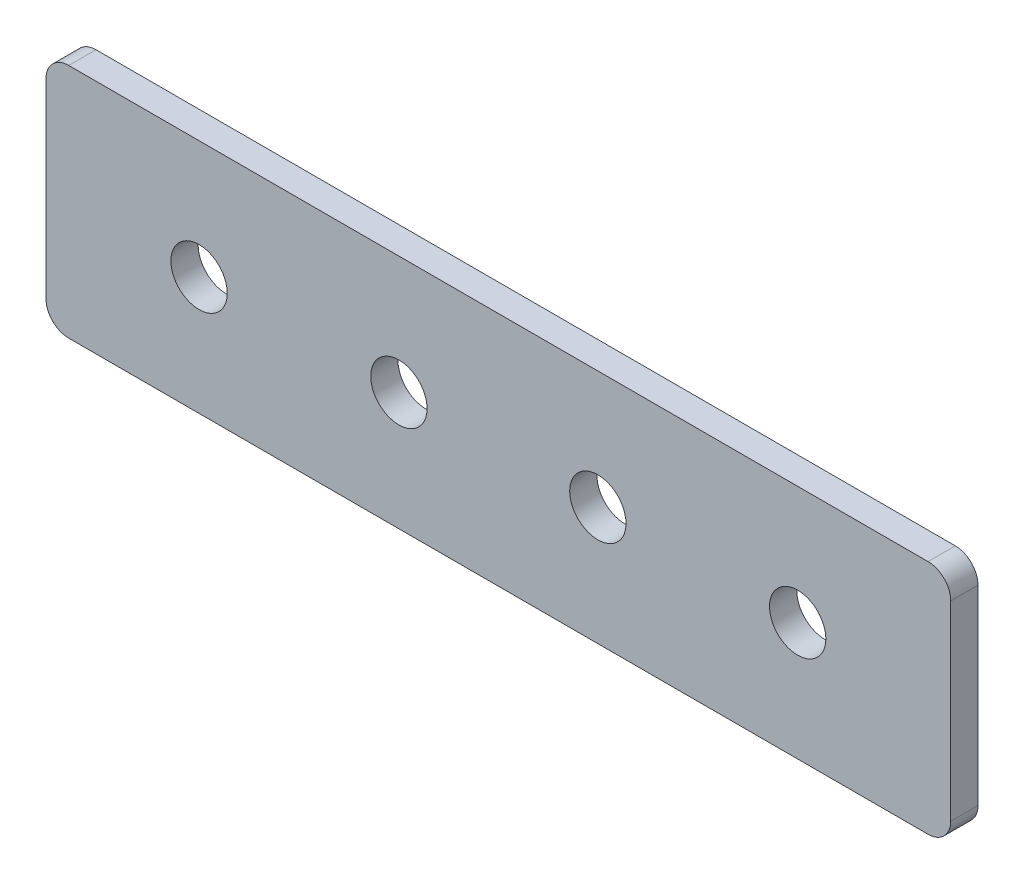
ISO-10303-21;
HEADER;
FILE_DESCRIPTION(('STEP AP214'),'2;1');
FILE_NAME('part.step','',(''),(''),'','','');
FILE_SCHEMA(('AUTOMOTIVE_DESIGN { 1 0 10303 214 1 1 1 1 }'));
ENDSEC;
DATA;
#1=APPLICATION_CONTEXT('core data for automotive mechanical design processes');
#2=APPLICATION_PROTOCOL_DEFINITION('international standard','automotive_design',2000,#1);
#3=PRODUCT_CONTEXT('',#1,'mechanical');
#4=PRODUCT('Part','Part','',(#3));
#5=PRODUCT_RELATED_PRODUCT_CATEGORY('part','',(#4));
#6=PRODUCT_DEFINITION_FORMATION('','',#4);
#7=PRODUCT_DEFINITION_CONTEXT('part definition',#1,'design');
#8=PRODUCT_DEFINITION('design','',#6,#7);
#9=PRODUCT_DEFINITION_SHAPE('','',#8);
#10=(LENGTH_UNIT() NAMED_UNIT(*) SI_UNIT(.MILLI.,.METRE.));
#11=(NAMED_UNIT(*) PLANE_ANGLE_UNIT() SI_UNIT($,.RADIAN.));
#12=(NAMED_UNIT(*) SI_UNIT($,.STERADIAN.) SOLID_ANGLE_UNIT());
#13=UNCERTAINTY_MEASURE_WITH_UNIT(LENGTH_MEASURE(1.E-05),#10,'distance_accuracy_value','');
#14=(GEOMETRIC_REPRESENTATION_CONTEXT(3) GLOBAL_UNCERTAINTY_ASSIGNED_CONTEXT((#13)) GLOBAL_UNIT_ASSIGNED_CONTEXT((#10,
#11,#12)) REPRESENTATION_CONTEXT('',''));
#15=CARTESIAN_POINT('',(0.,0.,0.));
#16=DIRECTION('',(0.,0.,1.));
#17=DIRECTION('',(1.,0.,0.));
#18=AXIS2_PLACEMENT_3D('',#15,#16,#17);
#19=CARTESIAN_POINT('',(49.8,-13.,2.5));
#20=DIRECTION('',(-1.,0.,0.));
#21=DIRECTION('',(0.,1.,0.));
#22=AXIS2_PLACEMENT_3D('',#19,#20,#21);
#23=PLANE('',#22);
#24=DIRECTION('',(0.,0.,1.));
#25=VECTOR('',#24,1.);
#26=CARTESIAN_POINT('',(49.8,-10.5,2.5));
#27=LINE('',#26,#25);
#28=CARTESIAN_POINT('',(49.8,-10.5,-0.5));
#29=VERTEX_POINT('',#28);
#30=CARTESIAN_POINT('',(49.8,-10.5,2.5));
#31=VERTEX_POINT('',#30);
#32=EDGE_CURVE('E11',#29,#31,#27,.T.);
#33=ORIENTED_EDGE('',*,*,#32,.F.);
#34=DIRECTION('',(0.,1.,0.));
#35=VECTOR('',#34,1.);
#36=CARTESIAN_POINT('',(49.8,0.,-0.5));
#37=LINE('',#36,#35);
#38=CARTESIAN_POINT('',(49.8,10.5,-0.5));
#39=VERTEX_POINT('',#38);
#40=EDGE_CURVE('E113',#29,#39,#37,.T.);
#41=ORIENTED_EDGE('',*,*,#40,.T.);
#42=DIRECTION('',(0.,0.,1.));
#43=VECTOR('',#42,1.);
#44=CARTESIAN_POINT('',(49.8,10.5,2.5));
#45=LINE('',#44,#43);
#46=CARTESIAN_POINT('',(49.8,10.5,2.5));
#47=VERTEX_POINT('',#46);
#48=EDGE_CURVE('E55',#39,#47,#45,.T.);
#49=ORIENTED_EDGE('',*,*,#48,.T.);
#50=DIRECTION('',(0.,1.,0.));
#51=VECTOR('',#50,1.);
#52=CARTESIAN_POINT('',(49.8,-13.,2.5));
#53=LINE('',#52,#51);
#54=EDGE_CURVE('E173',#31,#47,#53,.T.);
#55=ORIENTED_EDGE('',*,*,#54,.F.);
#56=EDGE_LOOP('',(#33,#41,#49,#55));
#57=FACE_BOUND('',#56,.T.);
#58=ADVANCED_FACE('F44',(#57),#23,.F.);
#59=CARTESIAN_POINT('',(47.3,10.5,2.5));
#60=DIRECTION('',(0.,0.,-1.));
#61=DIRECTION('',(-1.,0.,0.));
#62=AXIS2_PLACEMENT_3D('',#59,#60,#61);
#63=CYLINDRICAL_SURFACE('',#62,2.5);
#64=ORIENTED_EDGE('',*,*,#48,.F.);
#65=CARTESIAN_POINT('',(47.3,10.5,-0.5));
#66=DIRECTION('',(0.,0.,-1.));
#67=DIRECTION('',(-1.,0.,0.));
#68=AXIS2_PLACEMENT_3D('',#65,#66,#67);
#69=CIRCLE('',#68,2.5);
#70=CARTESIAN_POINT('',(47.3,13.,-0.5));
#71=VERTEX_POINT('',#70);
#72=EDGE_CURVE('E143',#39,#71,#69,.F.);
#73=ORIENTED_EDGE('',*,*,#72,.T.);
#74=DIRECTION('',(0.,0.,1.));
#75=VECTOR('',#74,1.);
#76=CARTESIAN_POINT('',(47.3,13.,2.5));
#77=LINE('',#76,#75);
#78=CARTESIAN_POINT('',(47.3,13.,2.5));
#79=VERTEX_POINT('',#78);
#80=EDGE_CURVE('E162',#71,#79,#77,.T.);
#81=ORIENTED_EDGE('',*,*,#80,.T.);
#82=CARTESIAN_POINT('',(47.3,10.5,2.5));
#83=DIRECTION('',(0.,0.,-1.));
#84=DIRECTION('',(-1.,0.,0.));
#85=AXIS2_PLACEMENT_3D('',#82,#83,#84);
#86=CIRCLE('',#85,2.5);
#87=EDGE_CURVE('E182',#47,#79,#86,.F.);
#88=ORIENTED_EDGE('',*,*,#87,.F.);
#89=EDGE_LOOP('',(#64,#73,#81,#88));
#90=FACE_BOUND('',#89,.T.);
#91=ADVANCED_FACE('F186',(#90),#63,.T.);
#92=CARTESIAN_POINT('',(-49.8,13.,2.5));
#93=DIRECTION('',(0.,-1.,0.));
#94=DIRECTION('',(-1.,0.,0.));
#95=AXIS2_PLACEMENT_3D('',#92,#93,#94);
#96=PLANE('',#95);
#97=ORIENTED_EDGE('',*,*,#80,.F.);
#98=DIRECTION('',(-1.,0.,0.));
#99=VECTOR('',#98,1.);
#100=CARTESIAN_POINT('',(0.,13.,-0.5));
#101=LINE('',#100,#99);
#102=CARTESIAN_POINT('',(-47.3,13.,-0.5));
#103=VERTEX_POINT('',#102);
#104=EDGE_CURVE('E139',#71,#103,#101,.T.);
#105=ORIENTED_EDGE('',*,*,#104,.T.);
#106=DIRECTION('',(0.,0.,1.));
#107=VECTOR('',#106,1.);
#108=CARTESIAN_POINT('',(-47.3,13.,2.5));
#109=LINE('',#108,#107);
#110=CARTESIAN_POINT('',(-47.3,13.,2.5));
#111=VERTEX_POINT('',#110);
#112=EDGE_CURVE('E158',#103,#111,#109,.T.);
#113=ORIENTED_EDGE('',*,*,#112,.T.);
#114=DIRECTION('',(-1.,0.,0.));
#115=VECTOR('',#114,1.);
#116=CARTESIAN_POINT('',(-49.8,13.,2.5));
#117=LINE('',#116,#115);
#118=EDGE_CURVE('E188',#79,#111,#117,.T.);
#119=ORIENTED_EDGE('',*,*,#118,.F.);
#120=EDGE_LOOP('',(#97,#105,#113,#119));
#121=FACE_BOUND('',#120,.T.);
#122=ADVANCED_FACE('F243',(#121),#96,.F.);
#123=CARTESIAN_POINT('',(-47.3,10.5,2.5));
#124=DIRECTION('',(0.,0.,-1.));
#125=DIRECTION('',(-1.,0.,0.));
#126=AXIS2_PLACEMENT_3D('',#123,#124,#125);
#127=CYLINDRICAL_SURFACE('',#126,2.5);
#128=ORIENTED_EDGE('',*,*,#112,.F.);
#129=CARTESIAN_POINT('',(-47.3,10.5,-0.5));
#130=DIRECTION('',(0.,0.,-1.));
#131=DIRECTION('',(-1.,0.,0.));
#132=AXIS2_PLACEMENT_3D('',#129,#130,#131);
#133=CIRCLE('',#132,2.5);
#134=CARTESIAN_POINT('',(-49.8,10.5,-0.5));
#135=VERTEX_POINT('',#134);
#136=EDGE_CURVE('E135',#103,#135,#133,.F.);
#137=ORIENTED_EDGE('',*,*,#136,.T.);
#138=DIRECTION('',(0.,0.,1.));
#139=VECTOR('',#138,1.);
#140=CARTESIAN_POINT('',(-49.8,10.5,2.5));
#141=LINE('',#140,#139);
#142=CARTESIAN_POINT('',(-49.8,10.5,2.5));
#143=VERTEX_POINT('',#142);
#144=EDGE_CURVE('E154',#135,#143,#141,.T.);
#145=ORIENTED_EDGE('',*,*,#144,.T.);
#146=CARTESIAN_POINT('',(-47.3,10.5,2.5));
#147=DIRECTION('',(0.,0.,-1.));
#148=DIRECTION('',(-1.,0.,0.));
#149=AXIS2_PLACEMENT_3D('',#146,#147,#148);
#150=CIRCLE('',#149,2.5);
#151=EDGE_CURVE('E192',#111,#143,#150,.F.);
#152=ORIENTED_EDGE('',*,*,#151,.F.);
#153=EDGE_LOOP('',(#128,#137,#145,#152));
#154=FACE_BOUND('',#153,.T.);
#155=ADVANCED_FACE('F248',(#154),#127,.T.);
#156=CARTESIAN_POINT('',(-49.8,-13.,2.5));
#157=DIRECTION('',(1.,0.,0.));
#158=DIRECTION('',(0.,-1.,0.));
#159=AXIS2_PLACEMENT_3D('',#156,#157,#158);
#160=PLANE('',#159);
#161=ORIENTED_EDGE('',*,*,#144,.F.);
#162=DIRECTION('',(0.,1.,0.));
#163=VECTOR('',#162,1.);
#164=CARTESIAN_POINT('',(-49.8,0.,-0.5));
#165=LINE('',#164,#163);
#166=CARTESIAN_POINT('',(-49.8,-10.5,-0.5));
#167=VERTEX_POINT('',#166);
#168=EDGE_CURVE('E132',#135,#167,#165,.F.);
#169=ORIENTED_EDGE('',*,*,#168,.T.);
#170=DIRECTION('',(0.,0.,1.));
#171=VECTOR('',#170,1.);
#172=CARTESIAN_POINT('',(-49.8,-10.5,2.5));
#173=LINE('',#172,#171);
#174=CARTESIAN_POINT('',(-49.8,-10.5,2.5));
#175=VERTEX_POINT('',#174);
#176=EDGE_CURVE('E151',#167,#175,#173,.T.);
#177=ORIENTED_EDGE('',*,*,#176,.T.);
#178=DIRECTION('',(0.,-1.,0.));
#179=VECTOR('',#178,1.);
#180=CARTESIAN_POINT('',(-49.8,-13.,2.5));
#181=LINE('',#180,#179);
#182=EDGE_CURVE('E199',#143,#175,#181,.T.);
#183=ORIENTED_EDGE('',*,*,#182,.F.);
#184=EDGE_LOOP('',(#161,#169,#177,#183));
#185=FACE_BOUND('',#184,.T.);
#186=ADVANCED_FACE('F252',(#185),#160,.F.);
#187=CARTESIAN_POINT('',(-47.3,-10.5,2.5));
#188=DIRECTION('',(0.,0.,-1.));
#189=DIRECTION('',(-1.,0.,0.));
#190=AXIS2_PLACEMENT_3D('',#187,#188,#189);
#191=CYLINDRICAL_SURFACE('',#190,2.5);
#192=ORIENTED_EDGE('',*,*,#176,.F.);
#193=CARTESIAN_POINT('',(-47.3,-10.5,-0.5));
#194=DIRECTION('',(0.,0.,-1.));
#195=DIRECTION('',(-1.,0.,0.));
#196=AXIS2_PLACEMENT_3D('',#193,#194,#195);
#197=CIRCLE('',#196,2.5);
#198=CARTESIAN_POINT('',(-47.3,-13.,-0.5));
#199=VERTEX_POINT('',#198);
#200=EDGE_CURVE('E128',#167,#199,#197,.F.);
#201=ORIENTED_EDGE('',*,*,#200,.T.);
#202=DIRECTION('',(0.,0.,1.));
#203=VECTOR('',#202,1.);
#204=CARTESIAN_POINT('',(-47.3,-13.,2.5));
#205=LINE('',#204,#203);
#206=CARTESIAN_POINT('',(-47.3,-13.,2.5));
#207=VERTEX_POINT('',#206);
#208=EDGE_CURVE('E63',#199,#207,#205,.T.);
#209=ORIENTED_EDGE('',*,*,#208,.T.);
#210=CARTESIAN_POINT('',(-47.3,-10.5,2.5));
#211=DIRECTION('',(0.,0.,-1.));
#212=DIRECTION('',(-1.,0.,0.));
#213=AXIS2_PLACEMENT_3D('',#210,#211,#212);
#214=CIRCLE('',#213,2.5);
#215=EDGE_CURVE('E106',#175,#207,#214,.F.);
#216=ORIENTED_EDGE('',*,*,#215,.F.);
#217=EDGE_LOOP('',(#192,#201,#209,#216));
#218=FACE_BOUND('',#217,.T.);
#219=ADVANCED_FACE('F256',(#218),#191,.T.);
#220=CARTESIAN_POINT('',(-49.8,-13.,2.5));
#221=DIRECTION('',(0.,1.,0.));
#222=DIRECTION('',(1.,0.,0.));
#223=AXIS2_PLACEMENT_3D('',#220,#221,#222);
#224=PLANE('',#223);
#225=ORIENTED_EDGE('',*,*,#208,.F.);
#226=DIRECTION('',(-1.,0.,0.));
#227=VECTOR('',#226,1.);
#228=CARTESIAN_POINT('',(0.,-13.,-0.5));
#229=LINE('',#228,#227);
#230=CARTESIAN_POINT('',(47.3,-13.,-0.5));
#231=VERTEX_POINT('',#230);
#232=EDGE_CURVE('E111',#199,#231,#229,.F.);
#233=ORIENTED_EDGE('',*,*,#232,.T.);
#234=DIRECTION('',(0.,0.,1.));
#235=VECTOR('',#234,1.);
#236=CARTESIAN_POINT('',(47.3,-13.,2.5));
#237=LINE('',#236,#235);
#238=CARTESIAN_POINT('',(47.3,-13.,2.5));
#239=VERTEX_POINT('',#238);
#240=EDGE_CURVE('E48',#231,#239,#237,.T.);
#241=ORIENTED_EDGE('',*,*,#240,.T.);
#242=DIRECTION('',(1.,0.,0.));
#243=VECTOR('',#242,1.);
#244=CARTESIAN_POINT('',(-49.8,-13.,2.5));
#245=LINE('',#244,#243);
#246=EDGE_CURVE('E291',#207,#239,#245,.T.);
#247=ORIENTED_EDGE('',*,*,#246,.F.);
#248=EDGE_LOOP('',(#225,#233,#241,#247));
#249=FACE_BOUND('',#248,.T.);
#250=ADVANCED_FACE('F116',(#249),#224,.F.);
#251=CARTESIAN_POINT('',(-32.95,0.,2.5));
#252=DIRECTION('',(0.,0.,-1.));
#253=DIRECTION('',(-1.,0.,0.));
#254=AXIS2_PLACEMENT_3D('',#251,#252,#253);
#255=CYLINDRICAL_SURFACE('',#254,3.1);
#256=CARTESIAN_POINT('',(-32.95,0.,2.5));
#257=DIRECTION('',(0.,0.,-1.));
#258=DIRECTION('',(-1.,0.,0.));
#259=AXIS2_PLACEMENT_3D('',#256,#257,#258);
#260=CIRCLE('',#259,3.1);
#261=CARTESIAN_POINT('',(-36.05,0.,2.5));
#262=VERTEX_POINT('',#261);
#263=EDGE_CURVE('E131',#262,#262,#260,.T.);
#264=ORIENTED_EDGE('',*,*,#263,.F.);
#265=EDGE_LOOP('',(#264));
#266=FACE_BOUND('',#265,.T.);
#267=CARTESIAN_POINT('',(-32.95,0.,-0.5));
#268=DIRECTION('',(0.,0.,-1.));
#269=DIRECTION('',(-1.,0.,0.));
#270=AXIS2_PLACEMENT_3D('',#267,#268,#269);
#271=CIRCLE('',#270,3.1);
#272=CARTESIAN_POINT('',(-36.05,0.,-0.5));
#273=VERTEX_POINT('',#272);
#274=EDGE_CURVE('E206',#273,#273,#271,.T.);
#275=ORIENTED_EDGE('',*,*,#274,.T.);
#276=EDGE_LOOP('',(#275));
#277=FACE_BOUND('',#276,.T.);
#278=ADVANCED_FACE('F260',(#266,#277),#255,.F.);
#279=CARTESIAN_POINT('',(10.95,0.,2.5));
#280=DIRECTION('',(0.,0.,-1.));
#281=DIRECTION('',(-1.,0.,0.));
#282=AXIS2_PLACEMENT_3D('',#279,#280,#281);
#283=CYLINDRICAL_SURFACE('',#282,3.1);
#284=CARTESIAN_POINT('',(10.95,0.,2.5));
#285=DIRECTION('',(0.,0.,-1.));
#286=DIRECTION('',(1.,0.,0.));
#287=AXIS2_PLACEMENT_3D('',#284,#285,#286);
#288=CIRCLE('',#287,3.1);
#289=CARTESIAN_POINT('',(14.05,0.,2.5));
#290=VERTEX_POINT('',#289);
#291=EDGE_CURVE('E283',#290,#290,#288,.T.);
#292=ORIENTED_EDGE('',*,*,#291,.F.);
#293=EDGE_LOOP('',(#292));
#294=FACE_BOUND('',#293,.T.);
#295=CARTESIAN_POINT('',(10.95,0.,-0.5));
#296=DIRECTION('',(0.,0.,-1.));
#297=DIRECTION('',(-1.,0.,0.));
#298=AXIS2_PLACEMENT_3D('',#295,#296,#297);
#299=CIRCLE('',#298,3.1);
#300=CARTESIAN_POINT('',(7.85000000000002,0.,-0.5));
#301=VERTEX_POINT('',#300);
#302=EDGE_CURVE('E210',#301,#301,#299,.T.);
#303=ORIENTED_EDGE('',*,*,#302,.T.);
#304=EDGE_LOOP('',(#303));
#305=FACE_BOUND('',#304,.T.);
#306=ADVANCED_FACE('F234',(#294,#305),#283,.F.);
#307=CARTESIAN_POINT('',(32.95,0.,2.5));
#308=DIRECTION('',(0.,0.,-1.));
#309=DIRECTION('',(-1.,0.,0.));
#310=AXIS2_PLACEMENT_3D('',#307,#308,#309);
#311=CYLINDRICAL_SURFACE('',#310,3.1);
#312=CARTESIAN_POINT('',(32.95,0.,2.5));
#313=DIRECTION('',(0.,0.,-1.));
#314=DIRECTION('',(1.,0.,0.));
#315=AXIS2_PLACEMENT_3D('',#312,#313,#314);
#316=CIRCLE('',#315,3.1);
#317=CARTESIAN_POINT('',(36.05,0.,2.5));
#318=VERTEX_POINT('',#317);
#319=EDGE_CURVE('E287',#318,#318,#316,.T.);
#320=ORIENTED_EDGE('',*,*,#319,.F.);
#321=EDGE_LOOP('',(#320));
#322=FACE_BOUND('',#321,.T.);
#323=CARTESIAN_POINT('',(32.95,0.,-0.5));
#324=DIRECTION('',(0.,0.,-1.));
#325=DIRECTION('',(-1.,0.,0.));
#326=AXIS2_PLACEMENT_3D('',#323,#324,#325);
#327=CIRCLE('',#326,3.1);
#328=CARTESIAN_POINT('',(29.85,0.,-0.5));
#329=VERTEX_POINT('',#328);
#330=EDGE_CURVE('E124',#329,#329,#327,.T.);
#331=ORIENTED_EDGE('',*,*,#330,.T.);
#332=EDGE_LOOP('',(#331));
#333=FACE_BOUND('',#332,.T.);
#334=ADVANCED_FACE('F218',(#322,#333),#311,.F.);
#335=CARTESIAN_POINT('',(-10.95,0.,2.5));
#336=DIRECTION('',(0.,0.,-1.));
#337=DIRECTION('',(-1.,0.,0.));
#338=AXIS2_PLACEMENT_3D('',#335,#336,#337);
#339=CYLINDRICAL_SURFACE('',#338,3.1);
#340=CARTESIAN_POINT('',(-10.95,0.,2.5));
#341=DIRECTION('',(0.,0.,-1.));
#342=DIRECTION('',(-1.,0.,0.));
#343=AXIS2_PLACEMENT_3D('',#340,#341,#342);
#344=CIRCLE('',#343,3.1);
#345=CARTESIAN_POINT('',(-14.05,0.,2.5));
#346=VERTEX_POINT('',#345);
#347=EDGE_CURVE('E289',#346,#346,#344,.T.);
#348=ORIENTED_EDGE('',*,*,#347,.F.);
#349=EDGE_LOOP('',(#348));
#350=FACE_BOUND('',#349,.T.);
#351=CARTESIAN_POINT('',(-10.95,0.,-0.5));
#352=DIRECTION('',(0.,0.,-1.));
#353=DIRECTION('',(-1.,0.,0.));
#354=AXIS2_PLACEMENT_3D('',#351,#352,#353);
#355=CIRCLE('',#354,3.1);
#356=CARTESIAN_POINT('',(-14.05,0.,-0.5));
#357=VERTEX_POINT('',#356);
#358=EDGE_CURVE('E118',#357,#357,#355,.T.);
#359=ORIENTED_EDGE('',*,*,#358,.T.);
#360=EDGE_LOOP('',(#359));
#361=FACE_BOUND('',#360,.T.);
#362=ADVANCED_FACE('F226',(#350,#361),#339,.F.);
#363=CARTESIAN_POINT('',(47.3,-10.5,2.5));
#364=DIRECTION('',(0.,0.,-1.));
#365=DIRECTION('',(-1.,0.,0.));
#366=AXIS2_PLACEMENT_3D('',#363,#364,#365);
#367=CYLINDRICAL_SURFACE('',#366,2.5);
#368=CARTESIAN_POINT('',(47.3,-10.5,-0.5));
#369=DIRECTION('',(0.,0.,-1.));
#370=DIRECTION('',(-1.,0.,0.));
#371=AXIS2_PLACEMENT_3D('',#368,#369,#370);
#372=CIRCLE('',#371,2.5);
#373=EDGE_CURVE('E99',#231,#29,#372,.F.);
#374=ORIENTED_EDGE('',*,*,#373,.T.);
#375=ORIENTED_EDGE('',*,*,#32,.T.);
#376=CARTESIAN_POINT('',(47.3,-10.5,2.5));
#377=DIRECTION('',(0.,0.,-1.));
#378=DIRECTION('',(-1.,0.,0.));
#379=AXIS2_PLACEMENT_3D('',#376,#377,#378);
#380=CIRCLE('',#379,2.5);
#381=EDGE_CURVE('E101',#239,#31,#380,.F.);
#382=ORIENTED_EDGE('',*,*,#381,.F.);
#383=ORIENTED_EDGE('',*,*,#240,.F.);
#384=EDGE_LOOP('',(#374,#375,#382,#383));
#385=FACE_BOUND('',#384,.T.);
#386=ADVANCED_FACE('F46',(#385),#367,.T.);
#387=CARTESIAN_POINT('',(0.,0.,2.5));
#388=DIRECTION('',(0.,0.,-1.));
#389=DIRECTION('',(-1.,0.,0.));
#390=AXIS2_PLACEMENT_3D('',#387,#388,#389);
#391=PLANE('',#390);
#392=ORIENTED_EDGE('',*,*,#263,.T.);
#393=EDGE_LOOP('',(#392));
#394=FACE_BOUND('',#393,.T.);
#395=ORIENTED_EDGE('',*,*,#291,.T.);
#396=EDGE_LOOP('',(#395));
#397=FACE_BOUND('',#396,.T.);
#398=ORIENTED_EDGE('',*,*,#319,.T.);
#399=EDGE_LOOP('',(#398));
#400=FACE_BOUND('',#399,.T.);
#401=ORIENTED_EDGE('',*,*,#347,.T.);
#402=EDGE_LOOP('',(#401));
#403=FACE_BOUND('',#402,.T.);
#404=ORIENTED_EDGE('',*,*,#246,.T.);
#405=ORIENTED_EDGE('',*,*,#381,.T.);
#406=ORIENTED_EDGE('',*,*,#54,.T.);
#407=ORIENTED_EDGE('',*,*,#87,.T.);
#408=ORIENTED_EDGE('',*,*,#118,.T.);
#409=ORIENTED_EDGE('',*,*,#151,.T.);
#410=ORIENTED_EDGE('',*,*,#182,.T.);
#411=ORIENTED_EDGE('',*,*,#215,.T.);
#412=EDGE_LOOP('',(#404,#405,#406,#407,#408,#409,#410,#411));
#413=FACE_BOUND('',#412,.T.);
#414=ADVANCED_FACE('F180',(#394,#397,#400,#403,#413),#391,.F.);
#415=CARTESIAN_POINT('',(0.,0.,-0.5));
#416=DIRECTION('',(0.,0.,-1.));
#417=DIRECTION('',(-1.,0.,0.));
#418=AXIS2_PLACEMENT_3D('',#415,#416,#417);
#419=PLANE('',#418);
#420=ORIENTED_EDGE('',*,*,#274,.F.);
#421=EDGE_LOOP('',(#420));
#422=FACE_BOUND('',#421,.T.);
#423=ORIENTED_EDGE('',*,*,#302,.F.);
#424=EDGE_LOOP('',(#423));
#425=FACE_BOUND('',#424,.T.);
#426=ORIENTED_EDGE('',*,*,#330,.F.);
#427=EDGE_LOOP('',(#426));
#428=FACE_BOUND('',#427,.T.);
#429=ORIENTED_EDGE('',*,*,#358,.F.);
#430=EDGE_LOOP('',(#429));
#431=FACE_BOUND('',#430,.T.);
#432=ORIENTED_EDGE('',*,*,#232,.F.);
#433=ORIENTED_EDGE('',*,*,#200,.F.);
#434=ORIENTED_EDGE('',*,*,#168,.F.);
#435=ORIENTED_EDGE('',*,*,#136,.F.);
#436=ORIENTED_EDGE('',*,*,#104,.F.);
#437=ORIENTED_EDGE('',*,*,#72,.F.);
#438=ORIENTED_EDGE('',*,*,#40,.F.);
#439=ORIENTED_EDGE('',*,*,#373,.F.);
#440=EDGE_LOOP('',(#432,#433,#434,#435,#436,#437,#438,#439));
#441=FACE_BOUND('',#440,.T.);
#442=ADVANCED_FACE('F109',(#422,#425,#428,#431,#441),#419,.T.);
#443=CLOSED_SHELL('',(#58,#91,#122,#155,#186,#219,#250,#278,#306,#334,#362,#386,#414,#442));
#444=MANIFOLD_SOLID_BREP('B2',#443);
#445=ADVANCED_BREP_SHAPE_REPRESENTATION('',(#18,#444),#14);
#446=SHAPE_DEFINITION_REPRESENTATION(#9,#445);
ENDSEC;
END-ISO-10303-21;
